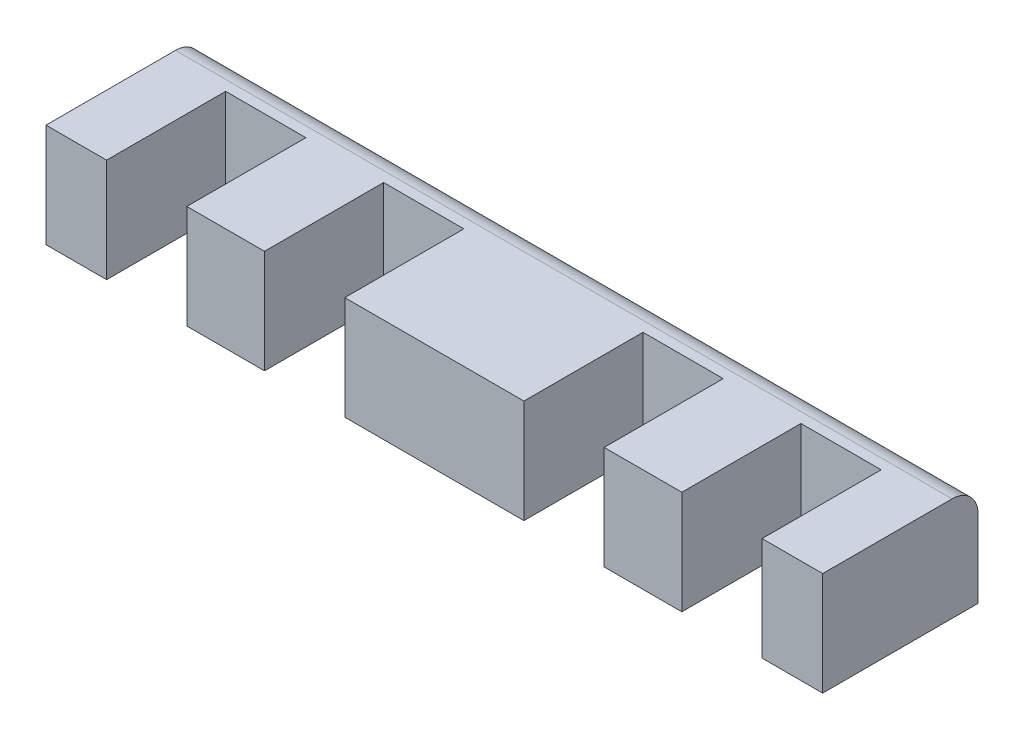
ISO-10303-21;
HEADER;
FILE_DESCRIPTION(('STEP AP214'),'2;1');
FILE_NAME('part.step','',(''),(''),'','','');
FILE_SCHEMA(('AUTOMOTIVE_DESIGN { 1 0 10303 214 1 1 1 1 }'));
ENDSEC;
DATA;
#1=APPLICATION_CONTEXT('core data for automotive mechanical design processes');
#2=APPLICATION_PROTOCOL_DEFINITION('international standard','automotive_design',2000,#1);
#3=PRODUCT_CONTEXT('',#1,'mechanical');
#4=PRODUCT('Part','Part','',(#3));
#5=PRODUCT_RELATED_PRODUCT_CATEGORY('part','',(#4));
#6=PRODUCT_DEFINITION_FORMATION('','',#4);
#7=PRODUCT_DEFINITION_CONTEXT('part definition',#1,'design');
#8=PRODUCT_DEFINITION('design','',#6,#7);
#9=PRODUCT_DEFINITION_SHAPE('','',#8);
#10=(LENGTH_UNIT() NAMED_UNIT(*) SI_UNIT(.MILLI.,.METRE.));
#11=(NAMED_UNIT(*) PLANE_ANGLE_UNIT() SI_UNIT($,.RADIAN.));
#12=(NAMED_UNIT(*) SI_UNIT($,.STERADIAN.) SOLID_ANGLE_UNIT());
#13=UNCERTAINTY_MEASURE_WITH_UNIT(LENGTH_MEASURE(1.E-05),#10,'distance_accuracy_value','');
#14=(GEOMETRIC_REPRESENTATION_CONTEXT(3) GLOBAL_UNCERTAINTY_ASSIGNED_CONTEXT((#13)) GLOBAL_UNIT_ASSIGNED_CONTEXT((#10,
#11,#12)) REPRESENTATION_CONTEXT('',''));
#15=CARTESIAN_POINT('',(0.,0.,0.));
#16=DIRECTION('',(0.,0.,1.));
#17=DIRECTION('',(1.,0.,0.));
#18=AXIS2_PLACEMENT_3D('',#15,#16,#17);
#19=CARTESIAN_POINT('',(0.,20.,15.));
#20=DIRECTION('',(0.,0.,-1.));
#21=DIRECTION('',(-1.,0.,0.));
#22=AXIS2_PLACEMENT_3D('',#19,#20,#21);
#23=PLANE('',#22);
#24=DIRECTION('',(1.,0.,0.));
#25=VECTOR('',#24,1.);
#26=CARTESIAN_POINT('',(0.,0.,15.));
#27=LINE('',#26,#25);
#28=CARTESIAN_POINT('',(-17.3,0.,15.));
#29=VERTEX_POINT('',#28);
#30=CARTESIAN_POINT('',(17.3,0.,15.));
#31=VERTEX_POINT('',#30);
#32=EDGE_CURVE('E211',#29,#31,#27,.T.);
#33=ORIENTED_EDGE('',*,*,#32,.T.);
#34=DIRECTION('',(0.,-1.,0.));
#35=VECTOR('',#34,1.);
#36=CARTESIAN_POINT('',(17.3,20.,15.));
#37=LINE('',#36,#35);
#38=CARTESIAN_POINT('',(17.3,20.,15.));
#39=VERTEX_POINT('',#38);
#40=EDGE_CURVE('E190',#39,#31,#37,.T.);
#41=ORIENTED_EDGE('',*,*,#40,.F.);
#42=DIRECTION('',(1.,0.,0.));
#43=VECTOR('',#42,1.);
#44=CARTESIAN_POINT('',(0.,20.,15.));
#45=LINE('',#44,#43);
#46=CARTESIAN_POINT('',(-17.3,20.,15.));
#47=VERTEX_POINT('',#46);
#48=EDGE_CURVE('E197',#47,#39,#45,.T.);
#49=ORIENTED_EDGE('',*,*,#48,.F.);
#50=DIRECTION('',(0.,-1.,0.));
#51=VECTOR('',#50,1.);
#52=CARTESIAN_POINT('',(-17.3,20.,15.));
#53=LINE('',#52,#51);
#54=EDGE_CURVE('E281',#47,#29,#53,.T.);
#55=ORIENTED_EDGE('',*,*,#54,.T.);
#56=EDGE_LOOP('',(#33,#41,#49,#55));
#57=FACE_BOUND('',#56,.T.);
#58=ADVANCED_FACE('F41',(#57),#23,.F.);
#59=CARTESIAN_POINT('',(17.3,20.,0.));
#60=DIRECTION('',(-1.,0.,0.));
#61=DIRECTION('',(0.,0.,1.));
#62=AXIS2_PLACEMENT_3D('',#59,#60,#61);
#63=PLANE('',#62);
#64=DIRECTION('',(0.,0.,-1.));
#65=VECTOR('',#64,1.);
#66=CARTESIAN_POINT('',(17.3,0.,0.));
#67=LINE('',#66,#65);
#68=CARTESIAN_POINT('',(17.3,0.,-8.));
#69=VERTEX_POINT('',#68);
#70=EDGE_CURVE('E341',#31,#69,#67,.T.);
#71=ORIENTED_EDGE('',*,*,#70,.T.);
#72=DIRECTION('',(0.,-1.,0.));
#73=VECTOR('',#72,1.);
#74=CARTESIAN_POINT('',(17.3,20.,-8.));
#75=LINE('',#74,#73);
#76=CARTESIAN_POINT('',(17.3,20.,-8.));
#77=VERTEX_POINT('',#76);
#78=EDGE_CURVE('E192',#77,#69,#75,.T.);
#79=ORIENTED_EDGE('',*,*,#78,.F.);
#80=DIRECTION('',(0.,0.,-1.));
#81=VECTOR('',#80,1.);
#82=CARTESIAN_POINT('',(17.3,20.,0.));
#83=LINE('',#82,#81);
#84=EDGE_CURVE('E185',#39,#77,#83,.T.);
#85=ORIENTED_EDGE('',*,*,#84,.F.);
#86=ORIENTED_EDGE('',*,*,#40,.T.);
#87=EDGE_LOOP('',(#71,#79,#85,#86));
#88=FACE_BOUND('',#87,.T.);
#89=ADVANCED_FACE('F188',(#88),#63,.F.);
#90=CARTESIAN_POINT('',(0.,20.,-8.));
#91=DIRECTION('',(0.,0.,1.));
#92=DIRECTION('',(1.,0.,0.));
#93=AXIS2_PLACEMENT_3D('',#90,#91,#92);
#94=PLANE('',#93);
#95=DIRECTION('',(-1.,0.,0.));
#96=VECTOR('',#95,1.);
#97=CARTESIAN_POINT('',(0.,0.,-8.));
#98=LINE('',#97,#96);
#99=CARTESIAN_POINT('',(32.8,0.,-8.));
#100=VERTEX_POINT('',#99);
#101=EDGE_CURVE('E337',#100,#69,#98,.T.);
#102=ORIENTED_EDGE('',*,*,#101,.F.);
#103=DIRECTION('',(0.,-1.,0.));
#104=VECTOR('',#103,1.);
#105=CARTESIAN_POINT('',(32.8,20.,-8.));
#106=LINE('',#105,#104);
#107=CARTESIAN_POINT('',(32.8,20.,-8.));
#108=VERTEX_POINT('',#107);
#109=EDGE_CURVE('E219',#108,#100,#106,.T.);
#110=ORIENTED_EDGE('',*,*,#109,.F.);
#111=DIRECTION('',(-1.,0.,0.));
#112=VECTOR('',#111,1.);
#113=CARTESIAN_POINT('',(0.,20.,-8.));
#114=LINE('',#113,#112);
#115=EDGE_CURVE('E196',#108,#77,#114,.T.);
#116=ORIENTED_EDGE('',*,*,#115,.T.);
#117=ORIENTED_EDGE('',*,*,#78,.T.);
#118=EDGE_LOOP('',(#102,#110,#116,#117));
#119=FACE_BOUND('',#118,.T.);
#120=ADVANCED_FACE('F390',(#119),#94,.T.);
#121=CARTESIAN_POINT('',(32.8,20.,0.));
#122=DIRECTION('',(-1.,0.,0.));
#123=DIRECTION('',(0.,0.,1.));
#124=AXIS2_PLACEMENT_3D('',#121,#122,#123);
#125=PLANE('',#124);
#126=DIRECTION('',(0.,0.,-1.));
#127=VECTOR('',#126,1.);
#128=CARTESIAN_POINT('',(32.8,0.,0.));
#129=LINE('',#128,#127);
#130=CARTESIAN_POINT('',(32.8,0.,15.));
#131=VERTEX_POINT('',#130);
#132=EDGE_CURVE('E333',#131,#100,#129,.T.);
#133=ORIENTED_EDGE('',*,*,#132,.F.);
#134=DIRECTION('',(0.,-1.,0.));
#135=VECTOR('',#134,1.);
#136=CARTESIAN_POINT('',(32.8,20.,15.));
#137=LINE('',#136,#135);
#138=CARTESIAN_POINT('',(32.8,20.,15.));
#139=VERTEX_POINT('',#138);
#140=EDGE_CURVE('E227',#139,#131,#137,.T.);
#141=ORIENTED_EDGE('',*,*,#140,.F.);
#142=DIRECTION('',(0.,0.,-1.));
#143=VECTOR('',#142,1.);
#144=CARTESIAN_POINT('',(32.8,20.,0.));
#145=LINE('',#144,#143);
#146=EDGE_CURVE('E383',#139,#108,#145,.T.);
#147=ORIENTED_EDGE('',*,*,#146,.T.);
#148=ORIENTED_EDGE('',*,*,#109,.T.);
#149=EDGE_LOOP('',(#133,#141,#147,#148));
#150=FACE_BOUND('',#149,.T.);
#151=ADVANCED_FACE('F394',(#150),#125,.T.);
#152=CARTESIAN_POINT('',(47.8,0.,15.));
#153=VERTEX_POINT('',#152);
#154=EDGE_CURVE('E332',#131,#153,#27,.T.);
#155=ORIENTED_EDGE('',*,*,#154,.T.);
#156=DIRECTION('',(0.,-1.,0.));
#157=VECTOR('',#156,1.);
#158=CARTESIAN_POINT('',(47.8,20.,15.));
#159=LINE('',#158,#157);
#160=CARTESIAN_POINT('',(47.8,20.,15.));
#161=VERTEX_POINT('',#160);
#162=EDGE_CURVE('E230',#161,#153,#159,.T.);
#163=ORIENTED_EDGE('',*,*,#162,.F.);
#164=EDGE_CURVE('E209',#139,#161,#45,.T.);
#165=ORIENTED_EDGE('',*,*,#164,.F.);
#166=ORIENTED_EDGE('',*,*,#140,.T.);
#167=EDGE_LOOP('',(#155,#163,#165,#166));
#168=FACE_BOUND('',#167,.T.);
#169=ADVANCED_FACE('F399',(#168),#23,.F.);
#170=CARTESIAN_POINT('',(47.8,20.,0.));
#171=DIRECTION('',(-1.,0.,0.));
#172=DIRECTION('',(0.,0.,1.));
#173=AXIS2_PLACEMENT_3D('',#170,#171,#172);
#174=PLANE('',#173);
#175=DIRECTION('',(0.,0.,-1.));
#176=VECTOR('',#175,1.);
#177=CARTESIAN_POINT('',(47.8,0.,0.));
#178=LINE('',#177,#176);
#179=CARTESIAN_POINT('',(47.8,0.,-8.));
#180=VERTEX_POINT('',#179);
#181=EDGE_CURVE('E328',#153,#180,#178,.T.);
#182=ORIENTED_EDGE('',*,*,#181,.T.);
#183=DIRECTION('',(0.,-1.,0.));
#184=VECTOR('',#183,1.);
#185=CARTESIAN_POINT('',(47.8,20.,-8.));
#186=LINE('',#185,#184);
#187=CARTESIAN_POINT('',(47.8,20.,-8.));
#188=VERTEX_POINT('',#187);
#189=EDGE_CURVE('E234',#188,#180,#186,.T.);
#190=ORIENTED_EDGE('',*,*,#189,.F.);
#191=DIRECTION('',(0.,0.,-1.));
#192=VECTOR('',#191,1.);
#193=CARTESIAN_POINT('',(47.8,20.,0.));
#194=LINE('',#193,#192);
#195=EDGE_CURVE('E380',#161,#188,#194,.T.);
#196=ORIENTED_EDGE('',*,*,#195,.F.);
#197=ORIENTED_EDGE('',*,*,#162,.T.);
#198=EDGE_LOOP('',(#182,#190,#196,#197));
#199=FACE_BOUND('',#198,.T.);
#200=ADVANCED_FACE('F469',(#199),#174,.F.);
#201=CARTESIAN_POINT('',(0.,20.,-7.99999999999999));
#202=DIRECTION('',(0.,0.,1.));
#203=DIRECTION('',(1.,0.,0.));
#204=AXIS2_PLACEMENT_3D('',#201,#202,#203);
#205=PLANE('',#204);
#206=DIRECTION('',(-1.,0.,0.));
#207=VECTOR('',#206,1.);
#208=CARTESIAN_POINT('',(0.,0.,-7.99999999999999));
#209=LINE('',#208,#207);
#210=CARTESIAN_POINT('',(63.3,0.,-8.));
#211=VERTEX_POINT('',#210);
#212=EDGE_CURVE('E324',#211,#180,#209,.T.);
#213=ORIENTED_EDGE('',*,*,#212,.F.);
#214=DIRECTION('',(0.,-1.,0.));
#215=VECTOR('',#214,1.);
#216=CARTESIAN_POINT('',(63.3,20.,-8.));
#217=LINE('',#216,#215);
#218=CARTESIAN_POINT('',(63.3,20.,-8.));
#219=VERTEX_POINT('',#218);
#220=EDGE_CURVE('E237',#219,#211,#217,.T.);
#221=ORIENTED_EDGE('',*,*,#220,.F.);
#222=DIRECTION('',(-1.,0.,0.));
#223=VECTOR('',#222,1.);
#224=CARTESIAN_POINT('',(0.,20.,-7.99999999999999));
#225=LINE('',#224,#223);
#226=EDGE_CURVE('E376',#219,#188,#225,.T.);
#227=ORIENTED_EDGE('',*,*,#226,.T.);
#228=ORIENTED_EDGE('',*,*,#189,.T.);
#229=EDGE_LOOP('',(#213,#221,#227,#228));
#230=FACE_BOUND('',#229,.T.);
#231=ADVANCED_FACE('F475',(#230),#205,.T.);
#232=CARTESIAN_POINT('',(63.3,20.,0.));
#233=DIRECTION('',(-1.,0.,0.));
#234=DIRECTION('',(0.,0.,1.));
#235=AXIS2_PLACEMENT_3D('',#232,#233,#234);
#236=PLANE('',#235);
#237=DIRECTION('',(0.,0.,-1.));
#238=VECTOR('',#237,1.);
#239=CARTESIAN_POINT('',(63.3,0.,0.));
#240=LINE('',#239,#238);
#241=CARTESIAN_POINT('',(63.3,0.,15.));
#242=VERTEX_POINT('',#241);
#243=EDGE_CURVE('E320',#242,#211,#240,.T.);
#244=ORIENTED_EDGE('',*,*,#243,.F.);
#245=DIRECTION('',(0.,-1.,0.));
#246=VECTOR('',#245,1.);
#247=CARTESIAN_POINT('',(63.3,20.,15.));
#248=LINE('',#247,#246);
#249=CARTESIAN_POINT('',(63.3,20.,15.));
#250=VERTEX_POINT('',#249);
#251=EDGE_CURVE('E240',#250,#242,#248,.T.);
#252=ORIENTED_EDGE('',*,*,#251,.F.);
#253=DIRECTION('',(0.,0.,-1.));
#254=VECTOR('',#253,1.);
#255=CARTESIAN_POINT('',(63.3,20.,0.));
#256=LINE('',#255,#254);
#257=EDGE_CURVE('E372',#250,#219,#256,.T.);
#258=ORIENTED_EDGE('',*,*,#257,.T.);
#259=ORIENTED_EDGE('',*,*,#220,.T.);
#260=EDGE_LOOP('',(#244,#252,#258,#259));
#261=FACE_BOUND('',#260,.T.);
#262=ADVANCED_FACE('F481',(#261),#236,.T.);
#263=CARTESIAN_POINT('',(75.,0.,15.));
#264=VERTEX_POINT('',#263);
#265=EDGE_CURVE('E319',#242,#264,#27,.T.);
#266=ORIENTED_EDGE('',*,*,#265,.T.);
#267=DIRECTION('',(0.,-1.,0.));
#268=VECTOR('',#267,1.);
#269=CARTESIAN_POINT('',(75.,20.,15.));
#270=LINE('',#269,#268);
#271=CARTESIAN_POINT('',(75.,20.,15.));
#272=VERTEX_POINT('',#271);
#273=EDGE_CURVE('E243',#272,#264,#270,.T.);
#274=ORIENTED_EDGE('',*,*,#273,.F.);
#275=EDGE_CURVE('E371',#250,#272,#45,.T.);
#276=ORIENTED_EDGE('',*,*,#275,.F.);
#277=ORIENTED_EDGE('',*,*,#251,.T.);
#278=EDGE_LOOP('',(#266,#274,#276,#277));
#279=FACE_BOUND('',#278,.T.);
#280=ADVANCED_FACE('F470',(#279),#23,.F.);
#281=CARTESIAN_POINT('',(75.,20.,0.));
#282=DIRECTION('',(-1.,0.,0.));
#283=DIRECTION('',(0.,0.,1.));
#284=AXIS2_PLACEMENT_3D('',#281,#282,#283);
#285=PLANE('',#284);
#286=DIRECTION('',(0.,-1.,0.));
#287=VECTOR('',#286,1.);
#288=CARTESIAN_POINT('',(75.,20.,-15.));
#289=LINE('',#288,#287);
#290=CARTESIAN_POINT('',(75.,15.,-15.));
#291=VERTEX_POINT('',#290);
#292=CARTESIAN_POINT('',(75.,0.,-15.));
#293=VERTEX_POINT('',#292);
#294=EDGE_CURVE('E247',#291,#293,#289,.T.);
#295=ORIENTED_EDGE('',*,*,#294,.F.);
#296=CARTESIAN_POINT('',(75.,15.,-10.));
#297=DIRECTION('',(-1.,0.,0.));
#298=DIRECTION('',(0.,0.,1.));
#299=AXIS2_PLACEMENT_3D('',#296,#297,#298);
#300=CIRCLE('',#299,5.);
#301=CARTESIAN_POINT('',(75.,20.,-10.));
#302=VERTEX_POINT('',#301);
#303=EDGE_CURVE('E64',#291,#302,#300,.F.);
#304=ORIENTED_EDGE('',*,*,#303,.T.);
#305=DIRECTION('',(0.,0.,-1.));
#306=VECTOR('',#305,1.);
#307=CARTESIAN_POINT('',(75.,20.,0.));
#308=LINE('',#307,#306);
#309=EDGE_CURVE('E368',#272,#302,#308,.T.);
#310=ORIENTED_EDGE('',*,*,#309,.F.);
#311=ORIENTED_EDGE('',*,*,#273,.T.);
#312=DIRECTION('',(0.,0.,-1.));
#313=VECTOR('',#312,1.);
#314=CARTESIAN_POINT('',(75.,0.,0.));
#315=LINE('',#314,#313);
#316=EDGE_CURVE('E315',#264,#293,#315,.T.);
#317=ORIENTED_EDGE('',*,*,#316,.T.);
#318=EDGE_LOOP('',(#295,#304,#310,#311,#317));
#319=FACE_BOUND('',#318,.T.);
#320=ADVANCED_FACE('F480',(#319),#285,.F.);
#321=CARTESIAN_POINT('',(0.,20.,-15.));
#322=DIRECTION('',(0.,0.,-1.));
#323=DIRECTION('',(-1.,0.,0.));
#324=AXIS2_PLACEMENT_3D('',#321,#322,#323);
#325=PLANE('',#324);
#326=DIRECTION('',(0.,-1.,0.));
#327=VECTOR('',#326,1.);
#328=CARTESIAN_POINT('',(-75.,20.,-15.));
#329=LINE('',#328,#327);
#330=CARTESIAN_POINT('',(-75.,15.,-15.));
#331=VERTEX_POINT('',#330);
#332=CARTESIAN_POINT('',(-75.,0.,-15.));
#333=VERTEX_POINT('',#332);
#334=EDGE_CURVE('E250',#331,#333,#329,.T.);
#335=ORIENTED_EDGE('',*,*,#334,.F.);
#336=DIRECTION('',(1.,0.,0.));
#337=VECTOR('',#336,1.);
#338=CARTESIAN_POINT('',(0.,15.,-15.));
#339=LINE('',#338,#337);
#340=EDGE_CURVE('E213',#331,#291,#339,.T.);
#341=ORIENTED_EDGE('',*,*,#340,.T.);
#342=ORIENTED_EDGE('',*,*,#294,.T.);
#343=DIRECTION('',(1.,0.,0.));
#344=VECTOR('',#343,1.);
#345=CARTESIAN_POINT('',(0.,0.,-15.));
#346=LINE('',#345,#344);
#347=EDGE_CURVE('E311',#333,#293,#346,.T.);
#348=ORIENTED_EDGE('',*,*,#347,.F.);
#349=EDGE_LOOP('',(#335,#341,#342,#348));
#350=FACE_BOUND('',#349,.T.);
#351=ADVANCED_FACE('F486',(#350),#325,.T.);
#352=CARTESIAN_POINT('',(-75.,20.,0.));
#353=DIRECTION('',(-1.,0.,0.));
#354=DIRECTION('',(0.,0.,1.));
#355=AXIS2_PLACEMENT_3D('',#352,#353,#354);
#356=PLANE('',#355);
#357=DIRECTION('',(0.,0.,-1.));
#358=VECTOR('',#357,1.);
#359=CARTESIAN_POINT('',(-75.,20.,0.));
#360=LINE('',#359,#358);
#361=CARTESIAN_POINT('',(-75.,20.,15.));
#362=VERTEX_POINT('',#361);
#363=CARTESIAN_POINT('',(-75.,20.,-10.));
#364=VERTEX_POINT('',#363);
#365=EDGE_CURVE('E365',#362,#364,#360,.T.);
#366=ORIENTED_EDGE('',*,*,#365,.T.);
#367=CARTESIAN_POINT('',(-75.,15.,-10.));
#368=DIRECTION('',(-1.,0.,0.));
#369=DIRECTION('',(0.,0.,1.));
#370=AXIS2_PLACEMENT_3D('',#367,#368,#369);
#371=CIRCLE('',#370,5.);
#372=EDGE_CURVE('E11',#364,#331,#371,.T.);
#373=ORIENTED_EDGE('',*,*,#372,.T.);
#374=ORIENTED_EDGE('',*,*,#334,.T.);
#375=DIRECTION('',(0.,0.,-1.));
#376=VECTOR('',#375,1.);
#377=CARTESIAN_POINT('',(-75.,0.,0.));
#378=LINE('',#377,#376);
#379=CARTESIAN_POINT('',(-75.,0.,15.));
#380=VERTEX_POINT('',#379);
#381=EDGE_CURVE('E307',#380,#333,#378,.T.);
#382=ORIENTED_EDGE('',*,*,#381,.F.);
#383=DIRECTION('',(0.,-1.,0.));
#384=VECTOR('',#383,1.);
#385=CARTESIAN_POINT('',(-75.,20.,15.));
#386=LINE('',#385,#384);
#387=EDGE_CURVE('E253',#362,#380,#386,.T.);
#388=ORIENTED_EDGE('',*,*,#387,.F.);
#389=EDGE_LOOP('',(#366,#373,#374,#382,#388));
#390=FACE_BOUND('',#389,.T.);
#391=ADVANCED_FACE('F491',(#390),#356,.T.);
#392=CARTESIAN_POINT('',(-63.3,0.,15.));
#393=VERTEX_POINT('',#392);
#394=EDGE_CURVE('E306',#380,#393,#27,.T.);
#395=ORIENTED_EDGE('',*,*,#394,.T.);
#396=DIRECTION('',(0.,-1.,0.));
#397=VECTOR('',#396,1.);
#398=CARTESIAN_POINT('',(-63.3,20.,15.));
#399=LINE('',#398,#397);
#400=CARTESIAN_POINT('',(-63.3,20.,15.));
#401=VERTEX_POINT('',#400);
#402=EDGE_CURVE('E256',#401,#393,#399,.T.);
#403=ORIENTED_EDGE('',*,*,#402,.F.);
#404=EDGE_CURVE('E364',#362,#401,#45,.T.);
#405=ORIENTED_EDGE('',*,*,#404,.F.);
#406=ORIENTED_EDGE('',*,*,#387,.T.);
#407=EDGE_LOOP('',(#395,#403,#405,#406));
#408=FACE_BOUND('',#407,.T.);
#409=ADVANCED_FACE('F440',(#408),#23,.F.);
#410=CARTESIAN_POINT('',(-63.3,20.,0.));
#411=DIRECTION('',(-1.,0.,0.));
#412=DIRECTION('',(0.,0.,1.));
#413=AXIS2_PLACEMENT_3D('',#410,#411,#412);
#414=PLANE('',#413);
#415=DIRECTION('',(0.,0.,-1.));
#416=VECTOR('',#415,1.);
#417=CARTESIAN_POINT('',(-63.3,0.,0.));
#418=LINE('',#417,#416);
#419=CARTESIAN_POINT('',(-63.3,0.,-8.));
#420=VERTEX_POINT('',#419);
#421=EDGE_CURVE('E303',#393,#420,#418,.T.);
#422=ORIENTED_EDGE('',*,*,#421,.T.);
#423=DIRECTION('',(0.,-1.,0.));
#424=VECTOR('',#423,1.);
#425=CARTESIAN_POINT('',(-63.3,20.,-8.));
#426=LINE('',#425,#424);
#427=CARTESIAN_POINT('',(-63.3,20.,-8.));
#428=VERTEX_POINT('',#427);
#429=EDGE_CURVE('E260',#428,#420,#426,.T.);
#430=ORIENTED_EDGE('',*,*,#429,.F.);
#431=DIRECTION('',(0.,0.,-1.));
#432=VECTOR('',#431,1.);
#433=CARTESIAN_POINT('',(-63.3,20.,0.));
#434=LINE('',#433,#432);
#435=EDGE_CURVE('E361',#401,#428,#434,.T.);
#436=ORIENTED_EDGE('',*,*,#435,.F.);
#437=ORIENTED_EDGE('',*,*,#402,.T.);
#438=EDGE_LOOP('',(#422,#430,#436,#437));
#439=FACE_BOUND('',#438,.T.);
#440=ADVANCED_FACE('F445',(#439),#414,.F.);
#441=CARTESIAN_POINT('',(0.,20.,-8.));
#442=DIRECTION('',(0.,0.,-1.));
#443=DIRECTION('',(-1.,0.,0.));
#444=AXIS2_PLACEMENT_3D('',#441,#442,#443);
#445=PLANE('',#444);
#446=DIRECTION('',(1.,0.,0.));
#447=VECTOR('',#446,1.);
#448=CARTESIAN_POINT('',(0.,0.,-8.));
#449=LINE('',#448,#447);
#450=CARTESIAN_POINT('',(-47.8,0.,-8.));
#451=VERTEX_POINT('',#450);
#452=EDGE_CURVE('E299',#420,#451,#449,.T.);
#453=ORIENTED_EDGE('',*,*,#452,.T.);
#454=DIRECTION('',(0.,-1.,0.));
#455=VECTOR('',#454,1.);
#456=CARTESIAN_POINT('',(-47.8,20.,-8.));
#457=LINE('',#456,#455);
#458=CARTESIAN_POINT('',(-47.8,20.,-8.));
#459=VERTEX_POINT('',#458);
#460=EDGE_CURVE('E264',#459,#451,#457,.T.);
#461=ORIENTED_EDGE('',*,*,#460,.F.);
#462=DIRECTION('',(1.,0.,0.));
#463=VECTOR('',#462,1.);
#464=CARTESIAN_POINT('',(0.,20.,-8.));
#465=LINE('',#464,#463);
#466=EDGE_CURVE('E358',#428,#459,#465,.T.);
#467=ORIENTED_EDGE('',*,*,#466,.F.);
#468=ORIENTED_EDGE('',*,*,#429,.T.);
#469=EDGE_LOOP('',(#453,#461,#467,#468));
#470=FACE_BOUND('',#469,.T.);
#471=ADVANCED_FACE('F451',(#470),#445,.F.);
#472=CARTESIAN_POINT('',(-47.8,20.,0.));
#473=DIRECTION('',(-1.,0.,0.));
#474=DIRECTION('',(0.,0.,1.));
#475=AXIS2_PLACEMENT_3D('',#472,#473,#474);
#476=PLANE('',#475);
#477=DIRECTION('',(0.,0.,-1.));
#478=VECTOR('',#477,1.);
#479=CARTESIAN_POINT('',(-47.8,0.,0.));
#480=LINE('',#479,#478);
#481=CARTESIAN_POINT('',(-47.8,0.,15.));
#482=VERTEX_POINT('',#481);
#483=EDGE_CURVE('E295',#482,#451,#480,.T.);
#484=ORIENTED_EDGE('',*,*,#483,.F.);
#485=DIRECTION('',(0.,-1.,0.));
#486=VECTOR('',#485,1.);
#487=CARTESIAN_POINT('',(-47.8,20.,15.));
#488=LINE('',#487,#486);
#489=CARTESIAN_POINT('',(-47.8,20.,15.));
#490=VERTEX_POINT('',#489);
#491=EDGE_CURVE('E267',#490,#482,#488,.T.);
#492=ORIENTED_EDGE('',*,*,#491,.F.);
#493=DIRECTION('',(0.,0.,-1.));
#494=VECTOR('',#493,1.);
#495=CARTESIAN_POINT('',(-47.8,20.,0.));
#496=LINE('',#495,#494);
#497=EDGE_CURVE('E354',#490,#459,#496,.T.);
#498=ORIENTED_EDGE('',*,*,#497,.T.);
#499=ORIENTED_EDGE('',*,*,#460,.T.);
#500=EDGE_LOOP('',(#484,#492,#498,#499));
#501=FACE_BOUND('',#500,.T.);
#502=ADVANCED_FACE('F454',(#501),#476,.T.);
#503=CARTESIAN_POINT('',(-32.8,0.,15.));
#504=VERTEX_POINT('',#503);
#505=EDGE_CURVE('E294',#482,#504,#27,.T.);
#506=ORIENTED_EDGE('',*,*,#505,.T.);
#507=DIRECTION('',(0.,-1.,0.));
#508=VECTOR('',#507,1.);
#509=CARTESIAN_POINT('',(-32.8,20.,15.));
#510=LINE('',#509,#508);
#511=CARTESIAN_POINT('',(-32.8,20.,15.));
#512=VERTEX_POINT('',#511);
#513=EDGE_CURVE('E270',#512,#504,#510,.T.);
#514=ORIENTED_EDGE('',*,*,#513,.F.);
#515=EDGE_CURVE('E208',#490,#512,#45,.T.);
#516=ORIENTED_EDGE('',*,*,#515,.F.);
#517=ORIENTED_EDGE('',*,*,#491,.T.);
#518=EDGE_LOOP('',(#506,#514,#516,#517));
#519=FACE_BOUND('',#518,.T.);
#520=ADVANCED_FACE('F416',(#519),#23,.F.);
#521=CARTESIAN_POINT('',(-32.8,20.,0.));
#522=DIRECTION('',(-1.,0.,0.));
#523=DIRECTION('',(0.,0.,1.));
#524=AXIS2_PLACEMENT_3D('',#521,#522,#523);
#525=PLANE('',#524);
#526=DIRECTION('',(0.,0.,-1.));
#527=VECTOR('',#526,1.);
#528=CARTESIAN_POINT('',(-32.8,0.,0.));
#529=LINE('',#528,#527);
#530=CARTESIAN_POINT('',(-32.8,0.,-8.));
#531=VERTEX_POINT('',#530);
#532=EDGE_CURVE('E291',#504,#531,#529,.T.);
#533=ORIENTED_EDGE('',*,*,#532,.T.);
#534=DIRECTION('',(0.,-1.,0.));
#535=VECTOR('',#534,1.);
#536=CARTESIAN_POINT('',(-32.8,20.,-8.));
#537=LINE('',#536,#535);
#538=CARTESIAN_POINT('',(-32.8,20.,-8.));
#539=VERTEX_POINT('',#538);
#540=EDGE_CURVE('E274',#539,#531,#537,.T.);
#541=ORIENTED_EDGE('',*,*,#540,.F.);
#542=DIRECTION('',(0.,0.,-1.));
#543=VECTOR('',#542,1.);
#544=CARTESIAN_POINT('',(-32.8,20.,0.));
#545=LINE('',#544,#543);
#546=EDGE_CURVE('E351',#512,#539,#545,.T.);
#547=ORIENTED_EDGE('',*,*,#546,.F.);
#548=ORIENTED_EDGE('',*,*,#513,.T.);
#549=EDGE_LOOP('',(#533,#541,#547,#548));
#550=FACE_BOUND('',#549,.T.);
#551=ADVANCED_FACE('F420',(#550),#525,.F.);
#552=CARTESIAN_POINT('',(0.,20.,-8.));
#553=DIRECTION('',(0.,0.,-1.));
#554=DIRECTION('',(-1.,0.,0.));
#555=AXIS2_PLACEMENT_3D('',#552,#553,#554);
#556=PLANE('',#555);
#557=DIRECTION('',(1.,0.,0.));
#558=VECTOR('',#557,1.);
#559=CARTESIAN_POINT('',(0.,0.,-8.));
#560=LINE('',#559,#558);
#561=CARTESIAN_POINT('',(-17.3,0.,-8.));
#562=VERTEX_POINT('',#561);
#563=EDGE_CURVE('E287',#531,#562,#560,.T.);
#564=ORIENTED_EDGE('',*,*,#563,.T.);
#565=DIRECTION('',(0.,-1.,0.));
#566=VECTOR('',#565,1.);
#567=CARTESIAN_POINT('',(-17.3,20.,-8.));
#568=LINE('',#567,#566);
#569=CARTESIAN_POINT('',(-17.3,20.,-8.));
#570=VERTEX_POINT('',#569);
#571=EDGE_CURVE('E278',#570,#562,#568,.T.);
#572=ORIENTED_EDGE('',*,*,#571,.F.);
#573=DIRECTION('',(1.,0.,0.));
#574=VECTOR('',#573,1.);
#575=CARTESIAN_POINT('',(0.,20.,-8.));
#576=LINE('',#575,#574);
#577=EDGE_CURVE('E348',#539,#570,#576,.T.);
#578=ORIENTED_EDGE('',*,*,#577,.F.);
#579=ORIENTED_EDGE('',*,*,#540,.T.);
#580=EDGE_LOOP('',(#564,#572,#578,#579));
#581=FACE_BOUND('',#580,.T.);
#582=ADVANCED_FACE('F425',(#581),#556,.F.);
#583=CARTESIAN_POINT('',(-17.3,20.,0.));
#584=DIRECTION('',(-1.,0.,0.));
#585=DIRECTION('',(0.,0.,1.));
#586=AXIS2_PLACEMENT_3D('',#583,#584,#585);
#587=PLANE('',#586);
#588=DIRECTION('',(0.,0.,-1.));
#589=VECTOR('',#588,1.);
#590=CARTESIAN_POINT('',(-17.3,0.,0.));
#591=LINE('',#590,#589);
#592=EDGE_CURVE('E206',#29,#562,#591,.T.);
#593=ORIENTED_EDGE('',*,*,#592,.F.);
#594=ORIENTED_EDGE('',*,*,#54,.F.);
#595=DIRECTION('',(0.,0.,-1.));
#596=VECTOR('',#595,1.);
#597=CARTESIAN_POINT('',(-17.3,20.,0.));
#598=LINE('',#597,#596);
#599=EDGE_CURVE('E203',#47,#570,#598,.T.);
#600=ORIENTED_EDGE('',*,*,#599,.T.);
#601=ORIENTED_EDGE('',*,*,#571,.T.);
#602=EDGE_LOOP('',(#593,#594,#600,#601));
#603=FACE_BOUND('',#602,.T.);
#604=ADVANCED_FACE('F428',(#603),#587,.T.);
#605=CARTESIAN_POINT('',(0.,20.,0.));
#606=DIRECTION('',(0.,1.,0.));
#607=DIRECTION('',(0.,0.,1.));
#608=AXIS2_PLACEMENT_3D('',#605,#606,#607);
#609=PLANE('',#608);
#610=ORIENTED_EDGE('',*,*,#309,.T.);
#611=DIRECTION('',(1.,0.,0.));
#612=VECTOR('',#611,1.);
#613=CARTESIAN_POINT('',(0.,20.,-10.));
#614=LINE('',#613,#612);
#615=EDGE_CURVE('E50',#302,#364,#614,.F.);
#616=ORIENTED_EDGE('',*,*,#615,.T.);
#617=ORIENTED_EDGE('',*,*,#365,.F.);
#618=ORIENTED_EDGE('',*,*,#404,.T.);
#619=ORIENTED_EDGE('',*,*,#435,.T.);
#620=ORIENTED_EDGE('',*,*,#466,.T.);
#621=ORIENTED_EDGE('',*,*,#497,.F.);
#622=ORIENTED_EDGE('',*,*,#515,.T.);
#623=ORIENTED_EDGE('',*,*,#546,.T.);
#624=ORIENTED_EDGE('',*,*,#577,.T.);
#625=ORIENTED_EDGE('',*,*,#599,.F.);
#626=ORIENTED_EDGE('',*,*,#48,.T.);
#627=ORIENTED_EDGE('',*,*,#84,.T.);
#628=ORIENTED_EDGE('',*,*,#115,.F.);
#629=ORIENTED_EDGE('',*,*,#146,.F.);
#630=ORIENTED_EDGE('',*,*,#164,.T.);
#631=ORIENTED_EDGE('',*,*,#195,.T.);
#632=ORIENTED_EDGE('',*,*,#226,.F.);
#633=ORIENTED_EDGE('',*,*,#257,.F.);
#634=ORIENTED_EDGE('',*,*,#275,.T.);
#635=EDGE_LOOP('',(#610,#616,#617,#618,#619,#620,#621,#622,#623,#624,#625,#626,#627,#628,#629,
#630,#631,#632,#633,#634));
#636=FACE_BOUND('',#635,.T.);
#637=ADVANCED_FACE('F201',(#636),#609,.T.);
#638=CARTESIAN_POINT('',(0.,0.,0.));
#639=DIRECTION('',(0.,1.,0.));
#640=DIRECTION('',(0.,0.,1.));
#641=AXIS2_PLACEMENT_3D('',#638,#639,#640);
#642=PLANE('',#641);
#643=ORIENTED_EDGE('',*,*,#32,.F.);
#644=ORIENTED_EDGE('',*,*,#592,.T.);
#645=ORIENTED_EDGE('',*,*,#563,.F.);
#646=ORIENTED_EDGE('',*,*,#532,.F.);
#647=ORIENTED_EDGE('',*,*,#505,.F.);
#648=ORIENTED_EDGE('',*,*,#483,.T.);
#649=ORIENTED_EDGE('',*,*,#452,.F.);
#650=ORIENTED_EDGE('',*,*,#421,.F.);
#651=ORIENTED_EDGE('',*,*,#394,.F.);
#652=ORIENTED_EDGE('',*,*,#381,.T.);
#653=ORIENTED_EDGE('',*,*,#347,.T.);
#654=ORIENTED_EDGE('',*,*,#316,.F.);
#655=ORIENTED_EDGE('',*,*,#265,.F.);
#656=ORIENTED_EDGE('',*,*,#243,.T.);
#657=ORIENTED_EDGE('',*,*,#212,.T.);
#658=ORIENTED_EDGE('',*,*,#181,.F.);
#659=ORIENTED_EDGE('',*,*,#154,.F.);
#660=ORIENTED_EDGE('',*,*,#132,.T.);
#661=ORIENTED_EDGE('',*,*,#101,.T.);
#662=ORIENTED_EDGE('',*,*,#70,.F.);
#663=EDGE_LOOP('',(#643,#644,#645,#646,#647,#648,#649,#650,#651,#652,#653,#654,#655,#656,#657,
#658,#659,#660,#661,#662));
#664=FACE_BOUND('',#663,.T.);
#665=ADVANCED_FACE('F430',(#664),#642,.F.);
#666=CARTESIAN_POINT('',(0.,15.,-10.));
#667=DIRECTION('',(1.,0.,0.));
#668=DIRECTION('',(0.,0.,-1.));
#669=AXIS2_PLACEMENT_3D('',#666,#667,#668);
#670=CYLINDRICAL_SURFACE('',#669,5.);
#671=ORIENTED_EDGE('',*,*,#372,.F.);
#672=ORIENTED_EDGE('',*,*,#615,.F.);
#673=ORIENTED_EDGE('',*,*,#303,.F.);
#674=ORIENTED_EDGE('',*,*,#340,.F.);
#675=EDGE_LOOP('',(#671,#672,#673,#674));
#676=FACE_BOUND('',#675,.T.);
#677=ADVANCED_FACE('F43',(#676),#670,.T.);
#678=CLOSED_SHELL('',(#58,#89,#120,#151,#169,#200,#231,#262,#280,#320,#351,#391,#409,#440,#471,
#502,#520,#551,#582,#604,#637,#665,#677));
#679=MANIFOLD_SOLID_BREP('B2',#678);
#680=ADVANCED_BREP_SHAPE_REPRESENTATION('',(#18,#679),#14);
#681=SHAPE_DEFINITION_REPRESENTATION(#9,#680);
ENDSEC;
END-ISO-10303-21;
